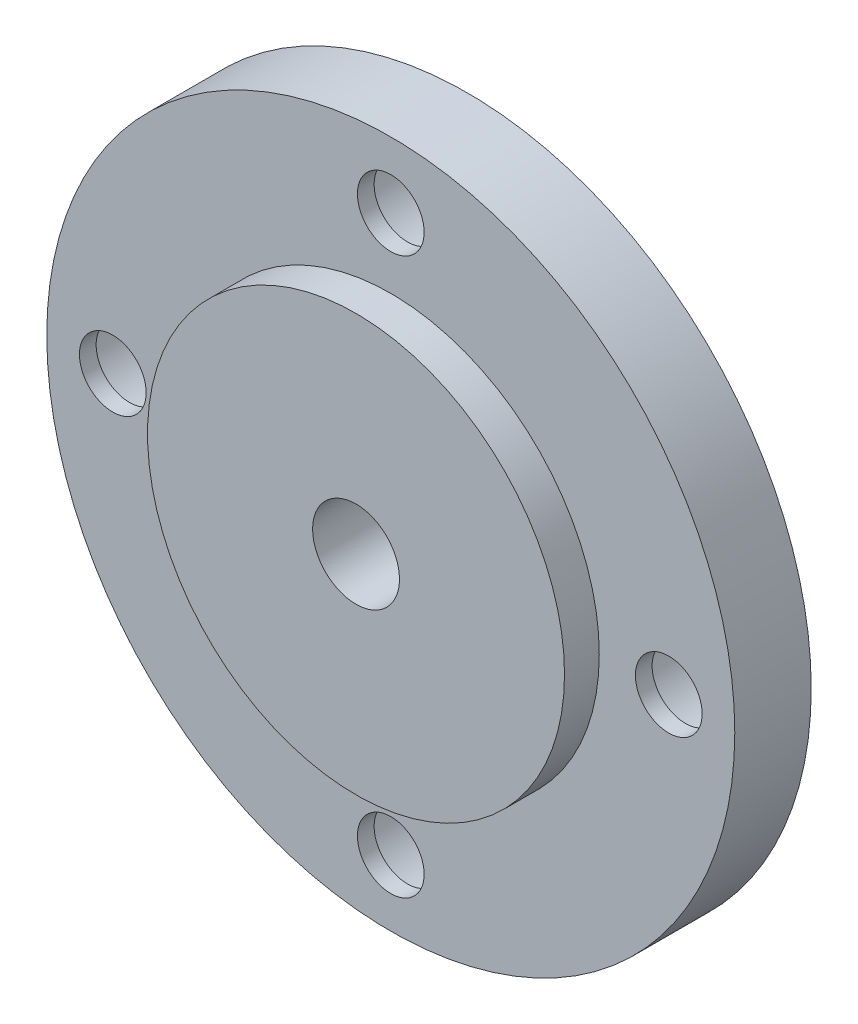
ISO-10303-21;
HEADER;
FILE_DESCRIPTION(('STEP AP214'),'2;1');
FILE_NAME('part.step','',(''),(''),'','','');
FILE_SCHEMA(('AUTOMOTIVE_DESIGN { 1 0 10303 214 1 1 1 1 }'));
ENDSEC;
DATA;
#1=APPLICATION_CONTEXT('core data for automotive mechanical design processes');
#2=APPLICATION_PROTOCOL_DEFINITION('international standard','automotive_design',2000,#1);
#3=PRODUCT_CONTEXT('',#1,'mechanical');
#4=PRODUCT('Part','Part','',(#3));
#5=PRODUCT_RELATED_PRODUCT_CATEGORY('part','',(#4));
#6=PRODUCT_DEFINITION_FORMATION('','',#4);
#7=PRODUCT_DEFINITION_CONTEXT('part definition',#1,'design');
#8=PRODUCT_DEFINITION('design','',#6,#7);
#9=PRODUCT_DEFINITION_SHAPE('','',#8);
#10=(LENGTH_UNIT() NAMED_UNIT(*) SI_UNIT(.MILLI.,.METRE.));
#11=(NAMED_UNIT(*) PLANE_ANGLE_UNIT() SI_UNIT($,.RADIAN.));
#12=(NAMED_UNIT(*) SI_UNIT($,.STERADIAN.) SOLID_ANGLE_UNIT());
#13=UNCERTAINTY_MEASURE_WITH_UNIT(LENGTH_MEASURE(1.E-05),#10,'distance_accuracy_value','');
#14=(GEOMETRIC_REPRESENTATION_CONTEXT(3) GLOBAL_UNCERTAINTY_ASSIGNED_CONTEXT((#13)) GLOBAL_UNIT_ASSIGNED_CONTEXT((#10,
#11,#12)) REPRESENTATION_CONTEXT('',''));
#15=CARTESIAN_POINT('',(0.,0.,0.));
#16=DIRECTION('',(0.,0.,1.));
#17=DIRECTION('',(1.,0.,0.));
#18=AXIS2_PLACEMENT_3D('',#15,#16,#17);
#19=CARTESIAN_POINT('',(0.,0.,2.794));
#20=DIRECTION('',(0.,0.,-1.));
#21=DIRECTION('',(-1.,0.,0.));
#22=AXIS2_PLACEMENT_3D('',#19,#20,#21);
#23=CYLINDRICAL_SURFACE('',#22,12.573);
#24=CARTESIAN_POINT('',(0.,0.,2.794));
#25=DIRECTION('',(0.,0.,1.));
#26=DIRECTION('',(1.,0.,0.));
#27=AXIS2_PLACEMENT_3D('',#24,#25,#26);
#28=CIRCLE('',#27,12.573);
#29=CARTESIAN_POINT('',(12.573,0.,2.794));
#30=VERTEX_POINT('',#29);
#31=EDGE_CURVE('E10',#30,#30,#28,.T.);
#32=ORIENTED_EDGE('',*,*,#31,.F.);
#33=EDGE_LOOP('',(#32));
#34=FACE_BOUND('',#33,.T.);
#35=CARTESIAN_POINT('',(0.,0.,0.));
#36=DIRECTION('',(0.,0.,1.));
#37=DIRECTION('',(1.,0.,0.));
#38=AXIS2_PLACEMENT_3D('',#35,#36,#37);
#39=CIRCLE('',#38,12.573);
#40=CARTESIAN_POINT('',(12.573,0.,0.));
#41=VERTEX_POINT('',#40);
#42=EDGE_CURVE('E40',#41,#41,#39,.T.);
#43=ORIENTED_EDGE('',*,*,#42,.T.);
#44=EDGE_LOOP('',(#43));
#45=FACE_BOUND('',#44,.T.);
#46=ADVANCED_FACE('F33',(#34,#45),#23,.T.);
#47=CARTESIAN_POINT('',(0.,0.,2.794));
#48=DIRECTION('',(0.,0.,1.));
#49=DIRECTION('',(1.,0.,0.));
#50=AXIS2_PLACEMENT_3D('',#47,#48,#49);
#51=PLANE('',#50);
#52=CARTESIAN_POINT('',(-1.06420351207939E-13,-10.16,2.794));
#53=DIRECTION('',(0.,0.,1.));
#54=DIRECTION('',(1.,0.,0.));
#55=AXIS2_PLACEMENT_3D('',#52,#53,#54);
#56=CIRCLE('',#55,1.2192);
#57=CARTESIAN_POINT('',(1.21919999999989,-10.16,2.794));
#58=VERTEX_POINT('',#57);
#59=EDGE_CURVE('E36',#58,#58,#56,.T.);
#60=ORIENTED_EDGE('',*,*,#59,.F.);
#61=EDGE_LOOP('',(#60));
#62=FACE_BOUND('',#61,.T.);
#63=CARTESIAN_POINT('',(10.16,0.,2.794));
#64=DIRECTION('',(0.,0.,1.));
#65=DIRECTION('',(1.,0.,0.));
#66=AXIS2_PLACEMENT_3D('',#63,#64,#65);
#67=CIRCLE('',#66,1.2192);
#68=CARTESIAN_POINT('',(11.3792,0.,2.794));
#69=VERTEX_POINT('',#68);
#70=EDGE_CURVE('E59',#69,#69,#67,.T.);
#71=ORIENTED_EDGE('',*,*,#70,.F.);
#72=EDGE_LOOP('',(#71));
#73=FACE_BOUND('',#72,.T.);
#74=CARTESIAN_POINT('',(0.,10.16,2.794));
#75=DIRECTION('',(0.,0.,1.));
#76=DIRECTION('',(1.,0.,0.));
#77=AXIS2_PLACEMENT_3D('',#74,#75,#76);
#78=CIRCLE('',#77,1.2192);
#79=CARTESIAN_POINT('',(1.21920000000003,10.16,2.794));
#80=VERTEX_POINT('',#79);
#81=EDGE_CURVE('E55',#80,#80,#78,.T.);
#82=ORIENTED_EDGE('',*,*,#81,.F.);
#83=EDGE_LOOP('',(#82));
#84=FACE_BOUND('',#83,.T.);
#85=CARTESIAN_POINT('',(-10.16,0.,2.794));
#86=DIRECTION('',(0.,0.,1.));
#87=DIRECTION('',(1.,0.,0.));
#88=AXIS2_PLACEMENT_3D('',#85,#86,#87);
#89=CIRCLE('',#88,1.2192);
#90=CARTESIAN_POINT('',(-8.9408,0.,2.794));
#91=VERTEX_POINT('',#90);
#92=EDGE_CURVE('E51',#91,#91,#89,.T.);
#93=ORIENTED_EDGE('',*,*,#92,.F.);
#94=EDGE_LOOP('',(#93));
#95=FACE_BOUND('',#94,.T.);
#96=CARTESIAN_POINT('',(0.,0.,2.794));
#97=DIRECTION('',(0.,0.,1.));
#98=DIRECTION('',(1.,0.,0.));
#99=AXIS2_PLACEMENT_3D('',#96,#97,#98);
#100=CIRCLE('',#99,7.62);
#101=CARTESIAN_POINT('',(7.62,0.,2.794));
#102=VERTEX_POINT('',#101);
#103=EDGE_CURVE('E48',#102,#102,#100,.T.);
#104=ORIENTED_EDGE('',*,*,#103,.F.);
#105=EDGE_LOOP('',(#104));
#106=FACE_BOUND('',#105,.T.);
#107=ORIENTED_EDGE('',*,*,#31,.T.);
#108=EDGE_LOOP('',(#107));
#109=FACE_BOUND('',#108,.T.);
#110=ADVANCED_FACE('F96',(#62,#73,#84,#95,#106,#109),#51,.T.);
#111=CARTESIAN_POINT('',(0.,0.,0.));
#112=DIRECTION('',(0.,0.,1.));
#113=DIRECTION('',(1.,0.,0.));
#114=AXIS2_PLACEMENT_3D('',#111,#112,#113);
#115=PLANE('',#114);
#116=CARTESIAN_POINT('',(0.,0.,0.));
#117=DIRECTION('',(0.,0.,-1.));
#118=DIRECTION('',(-1.,0.,0.));
#119=AXIS2_PLACEMENT_3D('',#116,#117,#118);
#120=CIRCLE('',#119,1.58749999999999);
#121=CARTESIAN_POINT('',(-1.58749999999999,0.,0.));
#122=VERTEX_POINT('',#121);
#123=EDGE_CURVE('E175',#122,#122,#120,.T.);
#124=ORIENTED_EDGE('',*,*,#123,.F.);
#125=EDGE_LOOP('',(#124));
#126=FACE_BOUND('',#125,.T.);
#127=CARTESIAN_POINT('',(-1.06420351207939E-13,-10.16,0.));
#128=DIRECTION('',(0.,0.,-1.));
#129=DIRECTION('',(-1.,0.,0.));
#130=AXIS2_PLACEMENT_3D('',#127,#128,#129);
#131=CIRCLE('',#130,2.38124999999999);
#132=CARTESIAN_POINT('',(-2.3812500000001,-10.16,0.));
#133=VERTEX_POINT('',#132);
#134=EDGE_CURVE('E177',#133,#133,#131,.T.);
#135=ORIENTED_EDGE('',*,*,#134,.F.);
#136=EDGE_LOOP('',(#135));
#137=FACE_BOUND('',#136,.T.);
#138=CARTESIAN_POINT('',(10.16,0.,0.));
#139=DIRECTION('',(0.,0.,-1.));
#140=DIRECTION('',(-1.,0.,0.));
#141=AXIS2_PLACEMENT_3D('',#138,#139,#140);
#142=CIRCLE('',#141,2.38124999999999);
#143=CARTESIAN_POINT('',(7.77875000000001,0.,0.));
#144=VERTEX_POINT('',#143);
#145=EDGE_CURVE('E74',#144,#144,#142,.T.);
#146=ORIENTED_EDGE('',*,*,#145,.F.);
#147=EDGE_LOOP('',(#146));
#148=FACE_BOUND('',#147,.T.);
#149=CARTESIAN_POINT('',(0.,10.16,0.));
#150=DIRECTION('',(0.,0.,-1.));
#151=DIRECTION('',(-1.,0.,0.));
#152=AXIS2_PLACEMENT_3D('',#149,#150,#151);
#153=CIRCLE('',#152,2.38124999999999);
#154=CARTESIAN_POINT('',(-2.38124999999996,10.16,0.));
#155=VERTEX_POINT('',#154);
#156=EDGE_CURVE('E61',#155,#155,#153,.T.);
#157=ORIENTED_EDGE('',*,*,#156,.F.);
#158=EDGE_LOOP('',(#157));
#159=FACE_BOUND('',#158,.T.);
#160=CARTESIAN_POINT('',(-10.16,0.,0.));
#161=DIRECTION('',(0.,0.,-1.));
#162=DIRECTION('',(-1.,0.,0.));
#163=AXIS2_PLACEMENT_3D('',#160,#161,#162);
#164=CIRCLE('',#163,2.38124999999999);
#165=CARTESIAN_POINT('',(-12.54125,0.,0.));
#166=VERTEX_POINT('',#165);
#167=EDGE_CURVE('E57',#166,#166,#164,.T.);
#168=ORIENTED_EDGE('',*,*,#167,.F.);
#169=EDGE_LOOP('',(#168));
#170=FACE_BOUND('',#169,.T.);
#171=ORIENTED_EDGE('',*,*,#42,.F.);
#172=EDGE_LOOP('',(#171));
#173=FACE_BOUND('',#172,.T.);
#174=ADVANCED_FACE('F98',(#126,#137,#148,#159,#170,#173),#115,.F.);
#175=CARTESIAN_POINT('',(0.,0.,4.064));
#176=DIRECTION('',(0.,0.,-1.));
#177=DIRECTION('',(-1.,0.,0.));
#178=AXIS2_PLACEMENT_3D('',#175,#176,#177);
#179=CYLINDRICAL_SURFACE('',#178,7.62);
#180=CARTESIAN_POINT('',(0.,0.,4.064));
#181=DIRECTION('',(0.,0.,1.));
#182=DIRECTION('',(1.,0.,0.));
#183=AXIS2_PLACEMENT_3D('',#180,#181,#182);
#184=CIRCLE('',#183,7.62);
#185=CARTESIAN_POINT('',(7.62,0.,4.064));
#186=VERTEX_POINT('',#185);
#187=EDGE_CURVE('E45',#186,#186,#184,.T.);
#188=ORIENTED_EDGE('',*,*,#187,.F.);
#189=EDGE_LOOP('',(#188));
#190=FACE_BOUND('',#189,.T.);
#191=ORIENTED_EDGE('',*,*,#103,.T.);
#192=EDGE_LOOP('',(#191));
#193=FACE_BOUND('',#192,.T.);
#194=ADVANCED_FACE('F94',(#190,#193),#179,.T.);
#195=CARTESIAN_POINT('',(0.,0.,4.064));
#196=DIRECTION('',(0.,0.,1.));
#197=DIRECTION('',(1.,0.,0.));
#198=AXIS2_PLACEMENT_3D('',#195,#196,#197);
#199=PLANE('',#198);
#200=CARTESIAN_POINT('',(0.,0.,4.064));
#201=DIRECTION('',(0.,0.,-1.));
#202=DIRECTION('',(-1.,0.,0.));
#203=AXIS2_PLACEMENT_3D('',#200,#201,#202);
#204=CIRCLE('',#203,1.5875);
#205=CARTESIAN_POINT('',(-1.5875,0.,4.064));
#206=VERTEX_POINT('',#205);
#207=EDGE_CURVE('E172',#206,#206,#204,.T.);
#208=ORIENTED_EDGE('',*,*,#207,.T.);
#209=EDGE_LOOP('',(#208));
#210=FACE_BOUND('',#209,.T.);
#211=ORIENTED_EDGE('',*,*,#187,.T.);
#212=EDGE_LOOP('',(#211));
#213=FACE_BOUND('',#212,.T.);
#214=ADVANCED_FACE('F112',(#210,#213),#199,.T.);
#215=CARTESIAN_POINT('',(-10.16,0.,0.));
#216=DIRECTION('',(0.,0.,-1.));
#217=DIRECTION('',(-1.,0.,0.));
#218=AXIS2_PLACEMENT_3D('',#215,#216,#217);
#219=CYLINDRICAL_SURFACE('',#218,1.2192);
#220=ORIENTED_EDGE('',*,*,#92,.T.);
#221=EDGE_LOOP('',(#220));
#222=FACE_BOUND('',#221,.T.);
#223=CARTESIAN_POINT('',(-10.16,0.,2.1844));
#224=DIRECTION('',(0.,0.,-1.));
#225=DIRECTION('',(-1.,0.,0.));
#226=AXIS2_PLACEMENT_3D('',#223,#224,#225);
#227=CIRCLE('',#226,1.2192);
#228=CARTESIAN_POINT('',(-11.3792,0.,2.1844));
#229=VERTEX_POINT('',#228);
#230=EDGE_CURVE('E54',#229,#229,#227,.T.);
#231=ORIENTED_EDGE('',*,*,#230,.T.);
#232=EDGE_LOOP('',(#231));
#233=FACE_BOUND('',#232,.T.);
#234=ADVANCED_FACE('F116',(#222,#233),#219,.F.);
#235=CARTESIAN_POINT('',(-8.9408,0.,2.1844));
#236=DIRECTION('',(0.,0.,1.));
#237=DIRECTION('',(1.,0.,0.));
#238=AXIS2_PLACEMENT_3D('',#235,#236,#237);
#239=PLANE('',#238);
#240=ORIENTED_EDGE('',*,*,#230,.F.);
#241=EDGE_LOOP('',(#240));
#242=FACE_BOUND('',#241,.T.);
#243=CARTESIAN_POINT('',(-10.16,0.,2.1844));
#244=DIRECTION('',(0.,0.,-1.));
#245=DIRECTION('',(-1.,0.,0.));
#246=AXIS2_PLACEMENT_3D('',#243,#244,#245);
#247=CIRCLE('',#246,2.38125);
#248=CARTESIAN_POINT('',(-12.54125,0.,2.1844));
#249=VERTEX_POINT('',#248);
#250=EDGE_CURVE('E84',#249,#249,#247,.T.);
#251=ORIENTED_EDGE('',*,*,#250,.T.);
#252=EDGE_LOOP('',(#251));
#253=FACE_BOUND('',#252,.T.);
#254=ADVANCED_FACE('F120',(#242,#253),#239,.F.);
#255=CARTESIAN_POINT('',(-10.16,0.,0.));
#256=DIRECTION('',(0.,0.,-1.));
#257=DIRECTION('',(-1.,0.,0.));
#258=AXIS2_PLACEMENT_3D('',#255,#256,#257);
#259=CYLINDRICAL_SURFACE('',#258,2.38124999999999);
#260=ORIENTED_EDGE('',*,*,#250,.F.);
#261=EDGE_LOOP('',(#260));
#262=FACE_BOUND('',#261,.T.);
#263=ORIENTED_EDGE('',*,*,#167,.T.);
#264=EDGE_LOOP('',(#263));
#265=FACE_BOUND('',#264,.T.);
#266=ADVANCED_FACE('F124',(#262,#265),#259,.F.);
#267=CARTESIAN_POINT('',(0.,10.16,0.));
#268=DIRECTION('',(0.,0.,-1.));
#269=DIRECTION('',(-1.,0.,0.));
#270=AXIS2_PLACEMENT_3D('',#267,#268,#269);
#271=CYLINDRICAL_SURFACE('',#270,1.2192);
#272=ORIENTED_EDGE('',*,*,#81,.T.);
#273=EDGE_LOOP('',(#272));
#274=FACE_BOUND('',#273,.T.);
#275=CARTESIAN_POINT('',(0.,10.16,2.1844));
#276=DIRECTION('',(0.,0.,-1.));
#277=DIRECTION('',(-1.,0.,0.));
#278=AXIS2_PLACEMENT_3D('',#275,#276,#277);
#279=CIRCLE('',#278,1.2192);
#280=CARTESIAN_POINT('',(-1.21919999999996,10.16,2.1844));
#281=VERTEX_POINT('',#280);
#282=EDGE_CURVE('E58',#281,#281,#279,.T.);
#283=ORIENTED_EDGE('',*,*,#282,.T.);
#284=EDGE_LOOP('',(#283));
#285=FACE_BOUND('',#284,.T.);
#286=ADVANCED_FACE('F128',(#274,#285),#271,.F.);
#287=CARTESIAN_POINT('',(1.21920000000003,10.16,2.1844));
#288=DIRECTION('',(0.,0.,1.));
#289=DIRECTION('',(1.,0.,0.));
#290=AXIS2_PLACEMENT_3D('',#287,#288,#289);
#291=PLANE('',#290);
#292=ORIENTED_EDGE('',*,*,#282,.F.);
#293=EDGE_LOOP('',(#292));
#294=FACE_BOUND('',#293,.T.);
#295=CARTESIAN_POINT('',(0.,10.16,2.1844));
#296=DIRECTION('',(0.,0.,-1.));
#297=DIRECTION('',(-1.,0.,0.));
#298=AXIS2_PLACEMENT_3D('',#295,#296,#297);
#299=CIRCLE('',#298,2.38125);
#300=CARTESIAN_POINT('',(-2.38124999999996,10.16,2.1844));
#301=VERTEX_POINT('',#300);
#302=EDGE_CURVE('E66',#301,#301,#299,.T.);
#303=ORIENTED_EDGE('',*,*,#302,.T.);
#304=EDGE_LOOP('',(#303));
#305=FACE_BOUND('',#304,.T.);
#306=ADVANCED_FACE('F132',(#294,#305),#291,.F.);
#307=CARTESIAN_POINT('',(0.,10.16,0.));
#308=DIRECTION('',(0.,0.,-1.));
#309=DIRECTION('',(-1.,0.,0.));
#310=AXIS2_PLACEMENT_3D('',#307,#308,#309);
#311=CYLINDRICAL_SURFACE('',#310,2.38124999999999);
#312=ORIENTED_EDGE('',*,*,#302,.F.);
#313=EDGE_LOOP('',(#312));
#314=FACE_BOUND('',#313,.T.);
#315=ORIENTED_EDGE('',*,*,#156,.T.);
#316=EDGE_LOOP('',(#315));
#317=FACE_BOUND('',#316,.T.);
#318=ADVANCED_FACE('F136',(#314,#317),#311,.F.);
#319=CARTESIAN_POINT('',(10.16,0.,0.));
#320=DIRECTION('',(0.,0.,-1.));
#321=DIRECTION('',(-1.,0.,0.));
#322=AXIS2_PLACEMENT_3D('',#319,#320,#321);
#323=CYLINDRICAL_SURFACE('',#322,1.2192);
#324=ORIENTED_EDGE('',*,*,#70,.T.);
#325=EDGE_LOOP('',(#324));
#326=FACE_BOUND('',#325,.T.);
#327=CARTESIAN_POINT('',(10.16,0.,2.1844));
#328=DIRECTION('',(0.,0.,-1.));
#329=DIRECTION('',(-1.,0.,0.));
#330=AXIS2_PLACEMENT_3D('',#327,#328,#329);
#331=CIRCLE('',#330,1.2192);
#332=CARTESIAN_POINT('',(8.9408,0.,2.1844));
#333=VERTEX_POINT('',#332);
#334=EDGE_CURVE('E62',#333,#333,#331,.T.);
#335=ORIENTED_EDGE('',*,*,#334,.T.);
#336=EDGE_LOOP('',(#335));
#337=FACE_BOUND('',#336,.T.);
#338=ADVANCED_FACE('F140',(#326,#337),#323,.F.);
#339=CARTESIAN_POINT('',(11.3792,0.,2.1844));
#340=DIRECTION('',(0.,0.,1.));
#341=DIRECTION('',(1.,0.,0.));
#342=AXIS2_PLACEMENT_3D('',#339,#340,#341);
#343=PLANE('',#342);
#344=ORIENTED_EDGE('',*,*,#334,.F.);
#345=EDGE_LOOP('',(#344));
#346=FACE_BOUND('',#345,.T.);
#347=CARTESIAN_POINT('',(10.16,0.,2.1844));
#348=DIRECTION('',(0.,0.,-1.));
#349=DIRECTION('',(-1.,0.,0.));
#350=AXIS2_PLACEMENT_3D('',#347,#348,#349);
#351=CIRCLE('',#350,2.38125);
#352=CARTESIAN_POINT('',(7.77875,0.,2.1844));
#353=VERTEX_POINT('',#352);
#354=EDGE_CURVE('E69',#353,#353,#351,.T.);
#355=ORIENTED_EDGE('',*,*,#354,.T.);
#356=EDGE_LOOP('',(#355));
#357=FACE_BOUND('',#356,.T.);
#358=ADVANCED_FACE('F144',(#346,#357),#343,.F.);
#359=CARTESIAN_POINT('',(10.16,0.,0.));
#360=DIRECTION('',(0.,0.,-1.));
#361=DIRECTION('',(-1.,0.,0.));
#362=AXIS2_PLACEMENT_3D('',#359,#360,#361);
#363=CYLINDRICAL_SURFACE('',#362,2.38125);
#364=ORIENTED_EDGE('',*,*,#354,.F.);
#365=EDGE_LOOP('',(#364));
#366=FACE_BOUND('',#365,.T.);
#367=ORIENTED_EDGE('',*,*,#145,.T.);
#368=EDGE_LOOP('',(#367));
#369=FACE_BOUND('',#368,.T.);
#370=ADVANCED_FACE('F147',(#366,#369),#363,.F.);
#371=CARTESIAN_POINT('',(-1.06420351207939E-13,-10.16,0.));
#372=DIRECTION('',(0.,0.,-1.));
#373=DIRECTION('',(-1.,0.,0.));
#374=AXIS2_PLACEMENT_3D('',#371,#372,#373);
#375=CYLINDRICAL_SURFACE('',#374,1.2192);
#376=ORIENTED_EDGE('',*,*,#59,.T.);
#377=EDGE_LOOP('',(#376));
#378=FACE_BOUND('',#377,.T.);
#379=CARTESIAN_POINT('',(-1.06420351207939E-13,-10.16,2.1844));
#380=DIRECTION('',(0.,0.,-1.));
#381=DIRECTION('',(-1.,0.,0.));
#382=AXIS2_PLACEMENT_3D('',#379,#380,#381);
#383=CIRCLE('',#382,1.2192);
#384=CARTESIAN_POINT('',(-1.2192000000001,-10.16,2.1844));
#385=VERTEX_POINT('',#384);
#386=EDGE_CURVE('E185',#385,#385,#383,.T.);
#387=ORIENTED_EDGE('',*,*,#386,.T.);
#388=EDGE_LOOP('',(#387));
#389=FACE_BOUND('',#388,.T.);
#390=ADVANCED_FACE('F151',(#378,#389),#375,.F.);
#391=CARTESIAN_POINT('',(1.21919999999989,-10.16,2.1844));
#392=DIRECTION('',(0.,0.,1.));
#393=DIRECTION('',(1.,0.,0.));
#394=AXIS2_PLACEMENT_3D('',#391,#392,#393);
#395=PLANE('',#394);
#396=ORIENTED_EDGE('',*,*,#386,.F.);
#397=EDGE_LOOP('',(#396));
#398=FACE_BOUND('',#397,.T.);
#399=CARTESIAN_POINT('',(-1.06420351207939E-13,-10.16,2.1844));
#400=DIRECTION('',(0.,0.,-1.));
#401=DIRECTION('',(-1.,0.,0.));
#402=AXIS2_PLACEMENT_3D('',#399,#400,#401);
#403=CIRCLE('',#402,2.38125);
#404=CARTESIAN_POINT('',(-2.3812500000001,-10.16,2.1844));
#405=VERTEX_POINT('',#404);
#406=EDGE_CURVE('E182',#405,#405,#403,.T.);
#407=ORIENTED_EDGE('',*,*,#406,.T.);
#408=EDGE_LOOP('',(#407));
#409=FACE_BOUND('',#408,.T.);
#410=ADVANCED_FACE('F155',(#398,#409),#395,.F.);
#411=CARTESIAN_POINT('',(-1.06420351207939E-13,-10.16,0.));
#412=DIRECTION('',(0.,0.,-1.));
#413=DIRECTION('',(-1.,0.,0.));
#414=AXIS2_PLACEMENT_3D('',#411,#412,#413);
#415=CYLINDRICAL_SURFACE('',#414,2.38124999999999);
#416=ORIENTED_EDGE('',*,*,#406,.F.);
#417=EDGE_LOOP('',(#416));
#418=FACE_BOUND('',#417,.T.);
#419=ORIENTED_EDGE('',*,*,#134,.T.);
#420=EDGE_LOOP('',(#419));
#421=FACE_BOUND('',#420,.T.);
#422=ADVANCED_FACE('F159',(#418,#421),#415,.F.);
#423=CARTESIAN_POINT('',(0.,0.,0.));
#424=DIRECTION('',(0.,0.,-1.));
#425=DIRECTION('',(-1.,0.,0.));
#426=AXIS2_PLACEMENT_3D('',#423,#424,#425);
#427=CYLINDRICAL_SURFACE('',#426,1.58749999999999);
#428=ORIENTED_EDGE('',*,*,#207,.F.);
#429=EDGE_LOOP('',(#428));
#430=FACE_BOUND('',#429,.T.);
#431=ORIENTED_EDGE('',*,*,#123,.T.);
#432=EDGE_LOOP('',(#431));
#433=FACE_BOUND('',#432,.T.);
#434=ADVANCED_FACE('F163',(#430,#433),#427,.F.);
#435=CLOSED_SHELL('',(#46,#110,#174,#194,#214,#234,#254,#266,#286,#306,#318,#338,#358,#370,#390,
#410,#422,#434));
#436=MANIFOLD_SOLID_BREP('B2',#435);
#437=ADVANCED_BREP_SHAPE_REPRESENTATION('',(#18,#436),#14);
#438=SHAPE_DEFINITION_REPRESENTATION(#9,#437);
ENDSEC;
END-ISO-10303-21;
